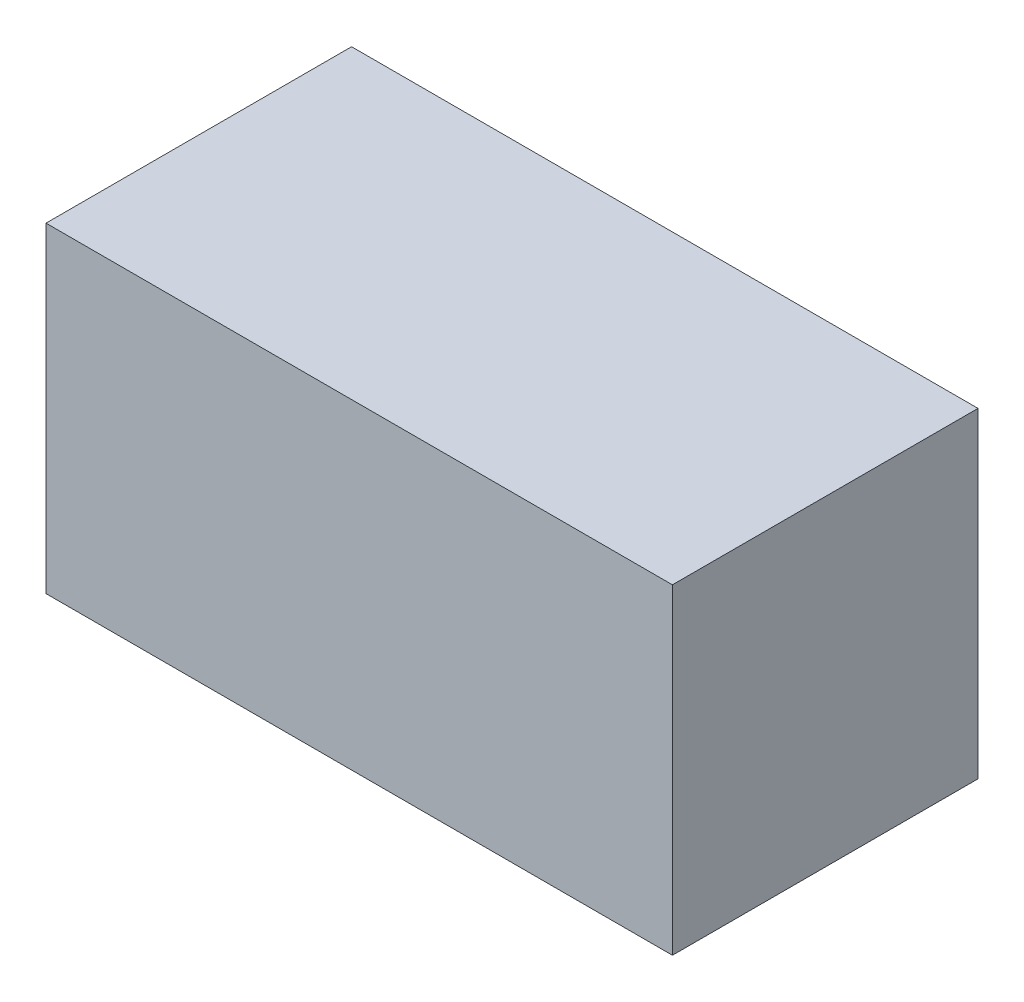
ISO-10303-21;
HEADER;
FILE_DESCRIPTION(('STEP AP214'),'2;1');
FILE_NAME('part.step','',(''),(''),'','','');
FILE_SCHEMA(('AUTOMOTIVE_DESIGN { 1 0 10303 214 1 1 1 1 }'));
ENDSEC;
DATA;
#1=APPLICATION_CONTEXT('core data for automotive mechanical design processes');
#2=APPLICATION_PROTOCOL_DEFINITION('international standard','automotive_design',2000,#1);
#3=PRODUCT_CONTEXT('',#1,'mechanical');
#4=PRODUCT('Part','Part','',(#3));
#5=PRODUCT_RELATED_PRODUCT_CATEGORY('part','',(#4));
#6=PRODUCT_DEFINITION_FORMATION('','',#4);
#7=PRODUCT_DEFINITION_CONTEXT('part definition',#1,'design');
#8=PRODUCT_DEFINITION('design','',#6,#7);
#9=PRODUCT_DEFINITION_SHAPE('','',#8);
#10=(LENGTH_UNIT() NAMED_UNIT(*) SI_UNIT(.MILLI.,.METRE.));
#11=(NAMED_UNIT(*) PLANE_ANGLE_UNIT() SI_UNIT($,.RADIAN.));
#12=(NAMED_UNIT(*) SI_UNIT($,.STERADIAN.) SOLID_ANGLE_UNIT());
#13=UNCERTAINTY_MEASURE_WITH_UNIT(LENGTH_MEASURE(1.E-05),#10,'distance_accuracy_value','');
#14=(GEOMETRIC_REPRESENTATION_CONTEXT(3) GLOBAL_UNCERTAINTY_ASSIGNED_CONTEXT((#13)) GLOBAL_UNIT_ASSIGNED_CONTEXT((#10,
#11,#12)) REPRESENTATION_CONTEXT('',''));
#15=CARTESIAN_POINT('',(0.,0.,0.));
#16=DIRECTION('',(0.,0.,1.));
#17=DIRECTION('',(1.,0.,0.));
#18=AXIS2_PLACEMENT_3D('',#15,#16,#17);
#19=CARTESIAN_POINT('',(0.,0.,20.));
#20=DIRECTION('',(1.,0.,0.));
#21=DIRECTION('',(0.,0.,-1.));
#22=AXIS2_PLACEMENT_3D('',#19,#20,#21);
#23=PLANE('',#22);
#24=DIRECTION('',(0.,-1.,0.));
#25=VECTOR('',#24,1.);
#26=CARTESIAN_POINT('',(0.,0.,0.));
#27=LINE('',#26,#25);
#28=CARTESIAN_POINT('',(0.,21.,0.));
#29=VERTEX_POINT('',#28);
#30=CARTESIAN_POINT('',(0.,0.,0.));
#31=VERTEX_POINT('',#30);
#32=EDGE_CURVE('E96',#29,#31,#27,.T.);
#33=ORIENTED_EDGE('',*,*,#32,.T.);
#34=DIRECTION('',(0.,0.,-1.));
#35=VECTOR('',#34,1.);
#36=CARTESIAN_POINT('',(0.,0.,20.));
#37=LINE('',#36,#35);
#38=CARTESIAN_POINT('',(0.,0.,20.));
#39=VERTEX_POINT('',#38);
#40=EDGE_CURVE('E11',#39,#31,#37,.T.);
#41=ORIENTED_EDGE('',*,*,#40,.F.);
#42=DIRECTION('',(0.,-1.,0.));
#43=VECTOR('',#42,1.);
#44=CARTESIAN_POINT('',(0.,0.,20.));
#45=LINE('',#44,#43);
#46=CARTESIAN_POINT('',(0.,21.,20.));
#47=VERTEX_POINT('',#46);
#48=EDGE_CURVE('E84',#47,#39,#45,.T.);
#49=ORIENTED_EDGE('',*,*,#48,.F.);
#50=DIRECTION('',(0.,0.,-1.));
#51=VECTOR('',#50,1.);
#52=CARTESIAN_POINT('',(0.,21.,20.));
#53=LINE('',#52,#51);
#54=EDGE_CURVE('E92',#47,#29,#53,.T.);
#55=ORIENTED_EDGE('',*,*,#54,.T.);
#56=EDGE_LOOP('',(#33,#41,#49,#55));
#57=FACE_BOUND('',#56,.T.);
#58=ADVANCED_FACE('F33',(#57),#23,.F.);
#59=CARTESIAN_POINT('',(0.,0.,20.));
#60=DIRECTION('',(0.,1.,0.));
#61=DIRECTION('',(0.,0.,1.));
#62=AXIS2_PLACEMENT_3D('',#59,#60,#61);
#63=PLANE('',#62);
#64=DIRECTION('',(1.,0.,0.));
#65=VECTOR('',#64,1.);
#66=CARTESIAN_POINT('',(0.,0.,0.));
#67=LINE('',#66,#65);
#68=CARTESIAN_POINT('',(41.,0.,0.));
#69=VERTEX_POINT('',#68);
#70=EDGE_CURVE('E88',#31,#69,#67,.T.);
#71=ORIENTED_EDGE('',*,*,#70,.T.);
#72=DIRECTION('',(0.,0.,-1.));
#73=VECTOR('',#72,1.);
#74=CARTESIAN_POINT('',(41.,0.,20.));
#75=LINE('',#74,#73);
#76=CARTESIAN_POINT('',(41.,0.,20.));
#77=VERTEX_POINT('',#76);
#78=EDGE_CURVE('E41',#77,#69,#75,.T.);
#79=ORIENTED_EDGE('',*,*,#78,.F.);
#80=DIRECTION('',(1.,0.,0.));
#81=VECTOR('',#80,1.);
#82=CARTESIAN_POINT('',(0.,0.,20.));
#83=LINE('',#82,#81);
#84=EDGE_CURVE('E79',#39,#77,#83,.T.);
#85=ORIENTED_EDGE('',*,*,#84,.F.);
#86=ORIENTED_EDGE('',*,*,#40,.T.);
#87=EDGE_LOOP('',(#71,#79,#85,#86));
#88=FACE_BOUND('',#87,.T.);
#89=ADVANCED_FACE('F87',(#88),#63,.F.);
#90=CARTESIAN_POINT('',(41.,0.,20.));
#91=DIRECTION('',(-1.,0.,0.));
#92=DIRECTION('',(0.,0.,1.));
#93=AXIS2_PLACEMENT_3D('',#90,#91,#92);
#94=PLANE('',#93);
#95=DIRECTION('',(0.,1.,0.));
#96=VECTOR('',#95,1.);
#97=CARTESIAN_POINT('',(41.,0.,0.));
#98=LINE('',#97,#96);
#99=CARTESIAN_POINT('',(41.,21.,0.));
#100=VERTEX_POINT('',#99);
#101=EDGE_CURVE('E66',#69,#100,#98,.T.);
#102=ORIENTED_EDGE('',*,*,#101,.T.);
#103=DIRECTION('',(0.,0.,-1.));
#104=VECTOR('',#103,1.);
#105=CARTESIAN_POINT('',(41.,21.,20.));
#106=LINE('',#105,#104);
#107=CARTESIAN_POINT('',(41.,21.,20.));
#108=VERTEX_POINT('',#107);
#109=EDGE_CURVE('E89',#108,#100,#106,.T.);
#110=ORIENTED_EDGE('',*,*,#109,.F.);
#111=DIRECTION('',(0.,1.,0.));
#112=VECTOR('',#111,1.);
#113=CARTESIAN_POINT('',(41.,0.,20.));
#114=LINE('',#113,#112);
#115=EDGE_CURVE('E82',#77,#108,#114,.T.);
#116=ORIENTED_EDGE('',*,*,#115,.F.);
#117=ORIENTED_EDGE('',*,*,#78,.T.);
#118=EDGE_LOOP('',(#102,#110,#116,#117));
#119=FACE_BOUND('',#118,.T.);
#120=ADVANCED_FACE('F90',(#119),#94,.F.);
#121=CARTESIAN_POINT('',(0.,21.,20.));
#122=DIRECTION('',(0.,-1.,0.));
#123=DIRECTION('',(0.,0.,-1.));
#124=AXIS2_PLACEMENT_3D('',#121,#122,#123);
#125=PLANE('',#124);
#126=DIRECTION('',(-1.,0.,0.));
#127=VECTOR('',#126,1.);
#128=CARTESIAN_POINT('',(0.,21.,0.));
#129=LINE('',#128,#127);
#130=EDGE_CURVE('E72',#100,#29,#129,.T.);
#131=ORIENTED_EDGE('',*,*,#130,.T.);
#132=ORIENTED_EDGE('',*,*,#54,.F.);
#133=DIRECTION('',(-1.,0.,0.));
#134=VECTOR('',#133,1.);
#135=CARTESIAN_POINT('',(0.,21.,20.));
#136=LINE('',#135,#134);
#137=EDGE_CURVE('E49',#108,#47,#136,.T.);
#138=ORIENTED_EDGE('',*,*,#137,.F.);
#139=ORIENTED_EDGE('',*,*,#109,.T.);
#140=EDGE_LOOP('',(#131,#132,#138,#139));
#141=FACE_BOUND('',#140,.T.);
#142=ADVANCED_FACE('F103',(#141),#125,.F.);
#143=CARTESIAN_POINT('',(0.,0.,20.));
#144=DIRECTION('',(0.,0.,-1.));
#145=DIRECTION('',(-1.,0.,0.));
#146=AXIS2_PLACEMENT_3D('',#143,#144,#145);
#147=PLANE('',#146);
#148=ORIENTED_EDGE('',*,*,#48,.T.);
#149=ORIENTED_EDGE('',*,*,#84,.T.);
#150=ORIENTED_EDGE('',*,*,#115,.T.);
#151=ORIENTED_EDGE('',*,*,#137,.T.);
#152=EDGE_LOOP('',(#148,#149,#150,#151));
#153=FACE_BOUND('',#152,.T.);
#154=ADVANCED_FACE('F80',(#153),#147,.F.);
#155=CARTESIAN_POINT('',(0.,0.,0.));
#156=DIRECTION('',(0.,0.,-1.));
#157=DIRECTION('',(-1.,0.,0.));
#158=AXIS2_PLACEMENT_3D('',#155,#156,#157);
#159=PLANE('',#158);
#160=ORIENTED_EDGE('',*,*,#32,.F.);
#161=ORIENTED_EDGE('',*,*,#130,.F.);
#162=ORIENTED_EDGE('',*,*,#101,.F.);
#163=ORIENTED_EDGE('',*,*,#70,.F.);
#164=EDGE_LOOP('',(#160,#161,#162,#163));
#165=FACE_BOUND('',#164,.T.);
#166=ADVANCED_FACE('F106',(#165),#159,.T.);
#167=CLOSED_SHELL('',(#58,#89,#120,#142,#154,#166));
#168=MANIFOLD_SOLID_BREP('B2',#167);
#169=ADVANCED_BREP_SHAPE_REPRESENTATION('',(#18,#168),#14);
#170=SHAPE_DEFINITION_REPRESENTATION(#9,#169);
ENDSEC;
END-ISO-10303-21;
